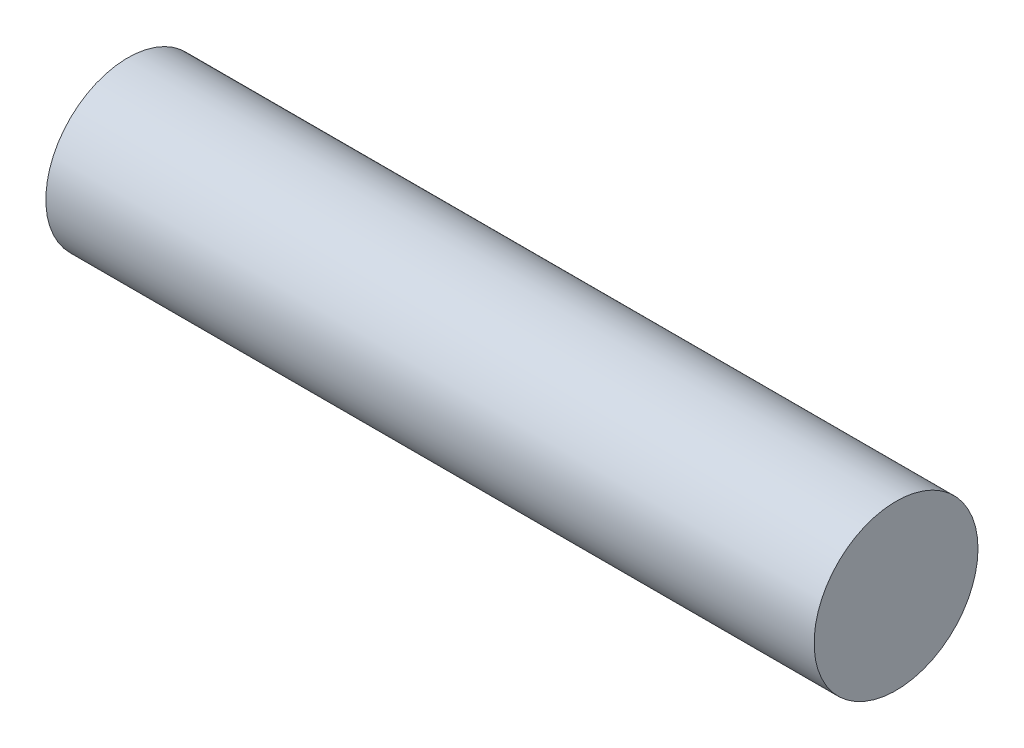
ISO-10303-21;
HEADER;
FILE_DESCRIPTION(('STEP AP214'),'2;1');
FILE_NAME('part.step','',(''),(''),'','','');
FILE_SCHEMA(('AUTOMOTIVE_DESIGN { 1 0 10303 214 1 1 1 1 }'));
ENDSEC;
DATA;
#1=APPLICATION_CONTEXT('core data for automotive mechanical design processes');
#2=APPLICATION_PROTOCOL_DEFINITION('international standard','automotive_design',2000,#1);
#3=PRODUCT_CONTEXT('',#1,'mechanical');
#4=PRODUCT('Part','Part','',(#3));
#5=PRODUCT_RELATED_PRODUCT_CATEGORY('part','',(#4));
#6=PRODUCT_DEFINITION_FORMATION('','',#4);
#7=PRODUCT_DEFINITION_CONTEXT('part definition',#1,'design');
#8=PRODUCT_DEFINITION('design','',#6,#7);
#9=PRODUCT_DEFINITION_SHAPE('','',#8);
#10=(LENGTH_UNIT() NAMED_UNIT(*) SI_UNIT(.MILLI.,.METRE.));
#11=(NAMED_UNIT(*) PLANE_ANGLE_UNIT() SI_UNIT($,.RADIAN.));
#12=(NAMED_UNIT(*) SI_UNIT($,.STERADIAN.) SOLID_ANGLE_UNIT());
#13=UNCERTAINTY_MEASURE_WITH_UNIT(LENGTH_MEASURE(1.E-05),#10,'distance_accuracy_value','');
#14=(GEOMETRIC_REPRESENTATION_CONTEXT(3) GLOBAL_UNCERTAINTY_ASSIGNED_CONTEXT((#13)) GLOBAL_UNIT_ASSIGNED_CONTEXT((#10,
#11,#12)) REPRESENTATION_CONTEXT('',''));
#15=CARTESIAN_POINT('',(0.,0.,0.));
#16=DIRECTION('',(0.,0.,1.));
#17=DIRECTION('',(1.,0.,0.));
#18=AXIS2_PLACEMENT_3D('',#15,#16,#17);
#19=CARTESIAN_POINT('',(37.5,0.,0.));
#20=DIRECTION('',(-1.,0.,0.));
#21=DIRECTION('',(0.,0.,1.));
#22=AXIS2_PLACEMENT_3D('',#19,#20,#21);
#23=CYLINDRICAL_SURFACE('',#22,4.);
#24=CARTESIAN_POINT('',(37.5,0.,0.));
#25=DIRECTION('',(1.,0.,0.));
#26=DIRECTION('',(0.,0.,-1.));
#27=AXIS2_PLACEMENT_3D('',#24,#25,#26);
#28=CIRCLE('',#27,4.);
#29=CARTESIAN_POINT('',(37.5,0.,-4.));
#30=VERTEX_POINT('',#29);
#31=EDGE_CURVE('E10',#30,#30,#28,.T.);
#32=ORIENTED_EDGE('',*,*,#31,.F.);
#33=EDGE_LOOP('',(#32));
#34=FACE_BOUND('',#33,.T.);
#35=CARTESIAN_POINT('',(0.,0.,0.));
#36=DIRECTION('',(1.,0.,0.));
#37=DIRECTION('',(0.,0.,-1.));
#38=AXIS2_PLACEMENT_3D('',#35,#36,#37);
#39=CIRCLE('',#38,4.);
#40=CARTESIAN_POINT('',(0.,0.,-4.));
#41=VERTEX_POINT('',#40);
#42=EDGE_CURVE('E33',#41,#41,#39,.T.);
#43=ORIENTED_EDGE('',*,*,#42,.T.);
#44=EDGE_LOOP('',(#43));
#45=FACE_BOUND('',#44,.T.);
#46=ADVANCED_FACE('F30',(#34,#45),#23,.T.);
#47=CARTESIAN_POINT('',(37.5,0.,0.));
#48=DIRECTION('',(1.,0.,0.));
#49=DIRECTION('',(0.,0.,-1.));
#50=AXIS2_PLACEMENT_3D('',#47,#48,#49);
#51=PLANE('',#50);
#52=ORIENTED_EDGE('',*,*,#31,.T.);
#53=EDGE_LOOP('',(#52));
#54=FACE_BOUND('',#53,.T.);
#55=ADVANCED_FACE('F45',(#54),#51,.T.);
#56=CARTESIAN_POINT('',(0.,0.,0.));
#57=DIRECTION('',(1.,0.,0.));
#58=DIRECTION('',(0.,0.,-1.));
#59=AXIS2_PLACEMENT_3D('',#56,#57,#58);
#60=PLANE('',#59);
#61=ORIENTED_EDGE('',*,*,#42,.F.);
#62=EDGE_LOOP('',(#61));
#63=FACE_BOUND('',#62,.T.);
#64=ADVANCED_FACE('F43',(#63),#60,.F.);
#65=CLOSED_SHELL('',(#46,#55,#64));
#66=MANIFOLD_SOLID_BREP('B2',#65);
#67=ADVANCED_BREP_SHAPE_REPRESENTATION('',(#18,#66),#14);
#68=SHAPE_DEFINITION_REPRESENTATION(#9,#67);
ENDSEC;
END-ISO-10303-21;
